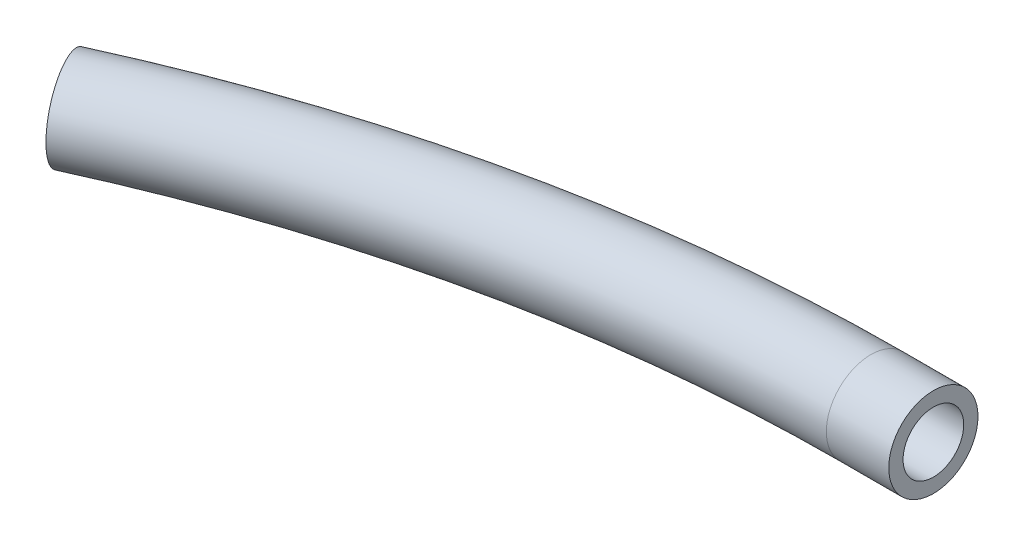
ISO-10303-21;
HEADER;
FILE_DESCRIPTION(('STEP AP214'),'2;1');
FILE_NAME('part.step','',(''),(''),'','','');
FILE_SCHEMA(('AUTOMOTIVE_DESIGN { 1 0 10303 214 1 1 1 1 }'));
ENDSEC;
DATA;
#1=APPLICATION_CONTEXT('core data for automotive mechanical design processes');
#2=APPLICATION_PROTOCOL_DEFINITION('international standard','automotive_design',2000,#1);
#3=PRODUCT_CONTEXT('',#1,'mechanical');
#4=PRODUCT('Part','Part','',(#3));
#5=PRODUCT_RELATED_PRODUCT_CATEGORY('part','',(#4));
#6=PRODUCT_DEFINITION_FORMATION('','',#4);
#7=PRODUCT_DEFINITION_CONTEXT('part definition',#1,'design');
#8=PRODUCT_DEFINITION('design','',#6,#7);
#9=PRODUCT_DEFINITION_SHAPE('','',#8);
#10=(LENGTH_UNIT() NAMED_UNIT(*) SI_UNIT(.MILLI.,.METRE.));
#11=(NAMED_UNIT(*) PLANE_ANGLE_UNIT() SI_UNIT($,.RADIAN.));
#12=(NAMED_UNIT(*) SI_UNIT($,.STERADIAN.) SOLID_ANGLE_UNIT());
#13=UNCERTAINTY_MEASURE_WITH_UNIT(LENGTH_MEASURE(1.E-05),#10,'distance_accuracy_value','');
#14=(GEOMETRIC_REPRESENTATION_CONTEXT(3) GLOBAL_UNCERTAINTY_ASSIGNED_CONTEXT((#13)) GLOBAL_UNIT_ASSIGNED_CONTEXT((#10,
#11,#12)) REPRESENTATION_CONTEXT('',''));
#15=CARTESIAN_POINT('',(0.,0.,0.));
#16=DIRECTION('',(0.,0.,1.));
#17=DIRECTION('',(1.,0.,0.));
#18=AXIS2_PLACEMENT_3D('',#15,#16,#17);
#19=CARTESIAN_POINT('',(-73.8886758177646,0.,-161.719830527667));
#20=DIRECTION('',(0.909560351674167,0.,-0.415571854993052));
#21=DIRECTION('',(-0.415571854993052,0.,-0.909560351674167));
#22=AXIS2_PLACEMENT_3D('',#19,#20,#21);
#23=PLANE('',#22);
#24=CARTESIAN_POINT('',(-73.8886758177646,0.,-161.719830527667));
#25=DIRECTION('',(0.909560351674167,0.,-0.415571854993052));
#26=DIRECTION('',(-0.415571854993052,0.,-0.909560351674167));
#27=AXIS2_PLACEMENT_3D('',#24,#25,#26);
#28=CIRCLE('',#27,2.74999999999999);
#29=CARTESIAN_POINT('',(-75.0314984189955,0.,-164.221121494771));
#30=VERTEX_POINT('',#29);
#31=EDGE_CURVE('E57',#30,#30,#28,.T.);
#32=ORIENTED_EDGE('',*,*,#31,.T.);
#33=EDGE_LOOP('',(#32));
#34=FACE_BOUND('',#33,.T.);
#35=CARTESIAN_POINT('',(-73.8886758177646,0.,-161.719830527667));
#36=DIRECTION('',(0.909560351674167,0.,-0.415571854993052));
#37=DIRECTION('',(-0.415571854993052,0.,-0.909560351674167));
#38=AXIS2_PLACEMENT_3D('',#35,#36,#37);
#39=CIRCLE('',#38,4.99999999999999);
#40=CARTESIAN_POINT('',(-75.9665350927299,0.,-166.267632286038));
#41=VERTEX_POINT('',#40);
#42=EDGE_CURVE('E11',#41,#41,#39,.T.);
#43=ORIENTED_EDGE('',*,*,#42,.F.);
#44=EDGE_LOOP('',(#43));
#45=FACE_BOUND('',#44,.T.);
#46=ADVANCED_FACE('F41',(#34,#45),#23,.F.);
#47=CARTESIAN_POINT('',(0.,0.,0.));
#48=DIRECTION('',(0.,1.,0.));
#49=DIRECTION('',(0.,0.,1.));
#50=AXIS2_PLACEMENT_3D('',#47,#48,#49);
#51=TOROIDAL_SURFACE('',#50,177.8,4.99999999999999);
#52=CARTESIAN_POINT('',(0.,0.,-177.8));
#53=DIRECTION('',(1.,0.,0.));
#54=DIRECTION('',(0.,0.,-1.));
#55=AXIS2_PLACEMENT_3D('',#52,#53,#54);
#56=CIRCLE('',#55,4.99999999999999);
#57=CARTESIAN_POINT('',(0.,0.,-182.8));
#58=VERTEX_POINT('',#57);
#59=EDGE_CURVE('E53',#58,#58,#56,.T.);
#60=CARTESIAN_POINT('',(0.,0.,0.));
#61=DIRECTION('',(0.,1.,0.));
#62=DIRECTION('',(0.,0.,1.));
#63=AXIS2_PLACEMENT_3D('',#60,#61,#62);
#64=CIRCLE('',#63,182.8);
#65=EDGE_CURVE('',#58,#41,#64,.T.);
#66=ORIENTED_EDGE('',*,*,#59,.F.);
#67=ORIENTED_EDGE('',*,*,#42,.T.);
#68=ORIENTED_EDGE('',*,*,#65,.T.);
#69=ORIENTED_EDGE('',*,*,#65,.F.);
#70=EDGE_LOOP('',(#66,#68,#67,#69));
#71=FACE_BOUND('',#70,.T.);
#72=ADVANCED_FACE('F88',(#71),#51,.T.);
#73=CARTESIAN_POINT('',(0.,0.,0.));
#74=DIRECTION('',(0.,1.,0.));
#75=DIRECTION('',(0.,0.,1.));
#76=AXIS2_PLACEMENT_3D('',#73,#74,#75);
#77=TOROIDAL_SURFACE('',#76,177.8,2.74999999999999);
#78=CARTESIAN_POINT('',(-0.390749736725656,-1.96086908300722,-179.727655219612));
#79=CARTESIAN_POINT('',(-0.390739613211904,-2.06916539177222,-179.617507206239));
#80=CARTESIAN_POINT('',(-0.390728624776831,-2.16823866224502,-179.498133318647));
#81=CARTESIAN_POINT('',(-0.390705215151311,-2.34501715452218,-179.244345367712));
#82=CARTESIAN_POINT('',(-0.390692792251182,-2.42269649676612,-179.109913363027));
#83=CARTESIAN_POINT('',(-0.390666864127176,-2.55434806169175,-178.82996606186));
#84=CARTESIAN_POINT('',(-0.390653359422575,-2.60833157892228,-178.684456084558));
#85=CARTESIAN_POINT('',(-0.390625638990404,-2.69108703041714,-178.386478033117));
#86=CARTESIAN_POINT('',(-0.390611423440347,-2.7198652260667,-178.23401169695));
#87=CARTESIAN_POINT('',(-0.390582673031696,-2.75142201259867,-177.926394396456));
#88=CARTESIAN_POINT('',(-0.390568138139304,-2.7541978380481,-177.771243148338));
#89=CARTESIAN_POINT('',(-0.390539161497552,-2.73366231634273,-177.462670857429));
#90=CARTESIAN_POINT('',(-0.390524719751873,-2.7103499447547,-177.309249882823));
#91=CARTESIAN_POINT('',(-0.390496344923124,-2.63829913259582,-177.008502160086));
#92=CARTESIAN_POINT('',(-0.390482411830862,-2.58956115175533,-176.861175301817));
#93=CARTESIAN_POINT('',(-0.390455459700915,-2.46804294620429,-176.576795405557));
#94=CARTESIAN_POINT('',(-0.390442440661389,-2.39526276991076,-176.439742346876));
#95=CARTESIAN_POINT('',(-0.390417700561475,-2.22772607801258,-176.179800120319));
#96=CARTESIAN_POINT('',(-0.390405979502416,-2.13296953991102,-176.056910966943));
#97=CARTESIAN_POINT('',(-0.390384185193915,-1.92417019883967,-175.828785421171));
#98=CARTESIAN_POINT('',(-0.390374111941488,-1.81012743080827,-175.723548996798));
#99=CARTESIAN_POINT('',(-0.390355916973071,-1.56599303445893,-175.533716171056));
#100=CARTESIAN_POINT('',(-0.390347795254008,-1.43590143141385,-175.449119737185));
#101=CARTESIAN_POINT('',(-0.390333750325048,-1.1633619909219,-175.302968074592));
#102=CARTESIAN_POINT('',(-0.390327827117446,-1.02091414058255,-175.24141286991));
#103=CARTESIAN_POINT('',(-0.390318360563753,-0.727706381922863,-175.143091316178));
#104=CARTESIAN_POINT('',(-0.390314817211754,-0.576946494236311,-175.106324905595));
#105=CARTESIAN_POINT('',(-0.390310219300128,-0.271394038944029,-175.058624410949));
#106=CARTESIAN_POINT('',(-0.390309164739471,-0.116601473008628,-175.047690316188));
#107=CARTESIAN_POINT('',(-0.390309576903126,0.192622085052984,-175.051964811236));
#108=CARTESIAN_POINT('',(-0.390311043624272,0.347053077633232,-175.0671733682));
#109=CARTESIAN_POINT('',(-0.39031645315811,0.651169862279038,-175.123301374735));
#110=CARTESIAN_POINT('',(-0.390320395971122,0.800855653735127,-175.164220827607));
#111=CARTESIAN_POINT('',(-0.390330636521875,1.09123287561924,-175.27060902939));
#112=CARTESIAN_POINT('',(-0.390336934259532,1.23192430637204,-175.336077777414));
#113=CARTESIAN_POINT('',(-0.390351692046724,1.50031900873539,-175.489706083243));
#114=CARTESIAN_POINT('',(-0.390360152096175,1.62802228085436,-175.577865640159));
#115=CARTESIAN_POINT('',(-0.390378977559429,1.86681575075358,-175.774373099753));
#116=CARTESIAN_POINT('',(-0.390389342975906,1.97790592521317,-175.882721030771));
#117=CARTESIAN_POINT('',(-0.390411667112915,2.18031949863696,-176.116529472628));
#118=CARTESIAN_POINT('',(-0.390423625833535,2.27164289648665,-176.241989984434));
#119=CARTESIAN_POINT('',(-0.390448780378897,2.43193072084765,-176.506462424448));
#120=CARTESIAN_POINT('',(-0.390461976206364,2.50089509812105,-176.645474382499));
#121=CARTESIAN_POINT('',(-0.390489216558001,2.61450692965163,-176.933103325946));
#122=CARTESIAN_POINT('',(-0.390503261082069,2.65915438680446,-177.081720310198));
#123=CARTESIAN_POINT('',(-0.390531790881553,2.72286505988271,-177.384340812945));
#124=CARTESIAN_POINT('',(-0.390546276157763,2.74192822963932,-177.538344341161));
#125=CARTESIAN_POINT('',(-0.390575272460604,2.75392904015826,-177.847366041825));
#126=CARTESIAN_POINT('',(-0.390589783487246,2.74686667016881,-178.002384214692));
#127=CARTESIAN_POINT('',(-0.390618421453144,2.70681682913794,-178.309034822712));
#128=CARTESIAN_POINT('',(-0.39063254839194,2.67382932707968,-178.460667253814));
#129=CARTESIAN_POINT('',(-0.390660024765593,2.58286563881625,-178.756241620717));
#130=CARTESIAN_POINT('',(-0.390673374201272,2.52488947901319,-178.900183564643));
#131=CARTESIAN_POINT('',(-0.390698928909949,2.38559430062304,-179.176290902224));
#132=CARTESIAN_POINT('',(-0.390711134184011,2.30427530375298,-179.308456306836));
#133=CARTESIAN_POINT('',(-0.39073406965903,2.12060264820634,-179.557259136088));
#134=CARTESIAN_POINT('',(-0.39074479985734,2.01824895179457,-179.673896532872));
#135=CARTESIAN_POINT('',(-0.39076449754195,1.79541291563717,-179.888331648147));
#136=CARTESIAN_POINT('',(-0.390773465034631,1.67493064152555,-179.986129434842));
#137=CARTESIAN_POINT('',(-0.390789399448272,1.41925702554325,-180.160109795445));
#138=CARTESIAN_POINT('',(-0.390796366365232,1.28406565426484,-180.236292326135));
#139=CARTESIAN_POINT('',(-0.390808116372921,1.00280948934117,-180.364880409238));
#140=CARTESIAN_POINT('',(-0.390812899427591,0.856744516204165,-180.417285569054));
#141=CARTESIAN_POINT('',(-0.390820156268482,0.55789521483986,-180.496827533915));
#142=CARTESIAN_POINT('',(-0.390822630145382,0.405111150714835,-180.523965331197));
#143=CARTESIAN_POINT('',(-0.390825204445803,0.0971728203335565,-180.552205222635));
#144=CARTESIAN_POINT('',(-0.390825305121451,-0.0579811923875047,-180.553310082523));
#145=CARTESIAN_POINT('',(-0.390823130456761,-0.366314653060246,-180.529453377328));
#146=CARTESIAN_POINT('',(-0.39082085452587,-0.519493600659029,-180.504485333497));
#147=CARTESIAN_POINT('',(-0.390813984564094,-0.819544352178254,-180.429176482979));
#148=CARTESIAN_POINT('',(-0.390809389427799,-0.966413112197841,-180.378823577041));
#149=CARTESIAN_POINT('',(-0.390798003225437,-1.24947913101603,-180.254196892818));
#150=CARTESIAN_POINT('',(-0.390791214807579,-1.38568901440846,-180.179951962646));
#151=CARTESIAN_POINT('',(-0.390778557277024,-1.59518994590687,-180.041719982959));
#152=CARTESIAN_POINT('',(-0.390773298469363,-1.6729170612744,-179.984331529517));
#153=CARTESIAN_POINT('',(-0.390762051265522,-1.82191966240272,-179.861714676697));
#154=CARTESIAN_POINT('',(-0.390756062869343,-1.89319514817248,-179.79648627733));
#155=CARTESIAN_POINT('',(-0.390749736725656,-1.96086908300722,-179.727655219612));
#156=B_SPLINE_CURVE_WITH_KNOTS('',3,(#78,#79,#80,#81,#82,#83,#84,#85,#86,#87,#88,#89,#90,#91,
#92,#93,#94,#95,#96,#97,#98,#99,#100,#101,#102,#103,#104,#105,#106,#107,#108,#109,#110,#111,
#112,#113,#114,#115,#116,#117,#118,#119,#120,#121,#122,#123,#124,#125,#126,#127,#128,#129,#130,
#131,#132,#133,#134,#135,#136,#137,#138,#139,#140,#141,#142,#143,#144,#145,#146,#147,#148,#149,
#150,#151,#152,#153,#154,#155),.UNSPECIFIED.,.T.,.F.,(4,2,2,2,2,2,2,2,2,2,2,2,2,2,2,2,2,2,2,2,2,
2,2,2,2,2,2,2,2,2,2,2,2,2,2,2,2,2,4),(0.,0.463054709444499,0.926667125602147,1.39005832159871,
1.8533343714985,2.31665969168854,2.78000320640974,3.24333834352646,3.70667254756833,
4.17000722592131,4.63334106491929,5.0966741742933,5.56000776711346,6.02334020980698,
6.48667246059195,6.95000412924748,7.41333585741262,7.87666756884688,8.33999926214408,
8.80333160583741,9.26666397565456,9.72999736579158,10.1933307007549,10.6566648718376,
11.1199992336025,11.5833341497016,12.0466685762592,12.5100025717546,12.9733373984551,
13.436670547705,13.9000046233086,14.3633463489151,14.8266698785446,15.2899441845949,
15.7533336351837,16.2169441613641,16.6799969942916,16.9693580503874,17.2587191060801),.UNSPECIFIED.);
#157=CARTESIAN_POINT('',(-0.390749736725656,-1.96086908300722,-179.727655219612));
#158=VERTEX_POINT('',#157);
#159=EDGE_CURVE('E44',#158,#158,#156,.T.);
#160=ORIENTED_EDGE('',*,*,#159,.F.);
#161=EDGE_LOOP('',(#160));
#162=FACE_BOUND('',#161,.T.);
#163=ORIENTED_EDGE('',*,*,#31,.F.);
#164=EDGE_LOOP('',(#163));
#165=FACE_BOUND('',#164,.T.);
#166=ADVANCED_FACE('F78',(#162,#165),#77,.F.);
#167=CARTESIAN_POINT('',(7.,0.,-177.8));
#168=DIRECTION('',(1.,0.,0.));
#169=DIRECTION('',(0.,0.,-1.));
#170=AXIS2_PLACEMENT_3D('',#167,#168,#169);
#171=PLANE('',#170);
#172=CARTESIAN_POINT('',(7.,0.,-177.8));
#173=DIRECTION('',(1.,0.,0.));
#174=DIRECTION('',(0.,0.,-1.));
#175=AXIS2_PLACEMENT_3D('',#172,#173,#174);
#176=CIRCLE('',#175,3.39999999999999);
#177=CARTESIAN_POINT('',(7.,0.,-181.2));
#178=VERTEX_POINT('',#177);
#179=EDGE_CURVE('E68',#178,#178,#176,.T.);
#180=ORIENTED_EDGE('',*,*,#179,.F.);
#181=EDGE_LOOP('',(#180));
#182=FACE_BOUND('',#181,.T.);
#183=CARTESIAN_POINT('',(7.,0.,-177.8));
#184=DIRECTION('',(1.,0.,0.));
#185=DIRECTION('',(0.,0.,-1.));
#186=AXIS2_PLACEMENT_3D('',#183,#184,#185);
#187=CIRCLE('',#186,5.);
#188=CARTESIAN_POINT('',(7.,0.,-182.8));
#189=VERTEX_POINT('',#188);
#190=EDGE_CURVE('E62',#189,#189,#187,.T.);
#191=ORIENTED_EDGE('',*,*,#190,.T.);
#192=EDGE_LOOP('',(#191));
#193=FACE_BOUND('',#192,.T.);
#194=ADVANCED_FACE('F74',(#182,#193),#171,.T.);
#195=CARTESIAN_POINT('',(0.,0.,-177.8));
#196=DIRECTION('',(1.,0.,0.));
#197=DIRECTION('',(0.,0.,-1.));
#198=AXIS2_PLACEMENT_3D('',#195,#196,#197);
#199=CYLINDRICAL_SURFACE('',#198,5.);
#200=ORIENTED_EDGE('',*,*,#190,.F.);
#201=EDGE_LOOP('',(#200));
#202=FACE_BOUND('',#201,.T.);
#203=ORIENTED_EDGE('',*,*,#59,.T.);
#204=EDGE_LOOP('',(#203));
#205=FACE_BOUND('',#204,.T.);
#206=ADVANCED_FACE('F77',(#202,#205),#199,.T.);
#207=CARTESIAN_POINT('',(-1.13999999986833E-05,0.,-177.8));
#208=DIRECTION('',(1.,0.,0.));
#209=DIRECTION('',(0.,0.,-1.));
#210=AXIS2_PLACEMENT_3D('',#207,#208,#209);
#211=CONICAL_SURFACE('',#210,3.4,1.02974425867665);
#212=ORIENTED_EDGE('',*,*,#159,.T.);
#213=EDGE_LOOP('',(#212));
#214=FACE_BOUND('',#213,.T.);
#215=CARTESIAN_POINT('',(-1.13999999986833E-05,0.,-177.8));
#216=DIRECTION('',(1.,0.,0.));
#217=DIRECTION('',(0.,0.,-1.));
#218=AXIS2_PLACEMENT_3D('',#215,#216,#217);
#219=CIRCLE('',#218,3.4);
#220=CARTESIAN_POINT('',(-1.13999999986833E-05,0.,-181.2));
#221=VERTEX_POINT('',#220);
#222=EDGE_CURVE('E65',#221,#221,#219,.T.);
#223=ORIENTED_EDGE('',*,*,#222,.T.);
#224=EDGE_LOOP('',(#223));
#225=FACE_BOUND('',#224,.T.);
#226=ADVANCED_FACE('F80',(#214,#225),#211,.F.);
#227=CARTESIAN_POINT('',(7.,0.,-177.8));
#228=DIRECTION('',(1.,0.,0.));
#229=DIRECTION('',(0.,0.,-1.));
#230=AXIS2_PLACEMENT_3D('',#227,#228,#229);
#231=CYLINDRICAL_SURFACE('',#230,3.39999999999999);
#232=ORIENTED_EDGE('',*,*,#222,.F.);
#233=EDGE_LOOP('',(#232));
#234=FACE_BOUND('',#233,.T.);
#235=ORIENTED_EDGE('',*,*,#179,.T.);
#236=EDGE_LOOP('',(#235));
#237=FACE_BOUND('',#236,.T.);
#238=ADVANCED_FACE('F72',(#234,#237),#231,.F.);
#239=CLOSED_SHELL('',(#46,#72,#166,#194,#206,#226,#238));
#240=MANIFOLD_SOLID_BREP('B2',#239);
#241=ADVANCED_BREP_SHAPE_REPRESENTATION('',(#18,#240),#14);
#242=SHAPE_DEFINITION_REPRESENTATION(#9,#241);
ENDSEC;
END-ISO-10303-21;
